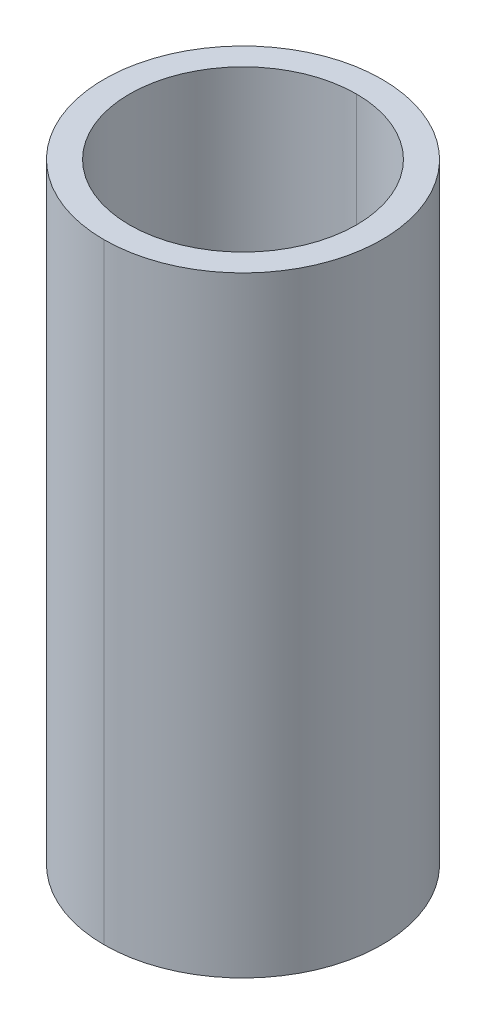
ISO-10303-21;
HEADER;
FILE_DESCRIPTION(('STEP AP214'),'2;1');
FILE_NAME('part.step','',(''),(''),'','','');
FILE_SCHEMA(('AUTOMOTIVE_DESIGN { 1 0 10303 214 1 1 1 1 }'));
ENDSEC;
DATA;
#1=APPLICATION_CONTEXT('core data for automotive mechanical design processes');
#2=APPLICATION_PROTOCOL_DEFINITION('international standard','automotive_design',2000,#1);
#3=PRODUCT_CONTEXT('',#1,'mechanical');
#4=PRODUCT('Part','Part','',(#3));
#5=PRODUCT_RELATED_PRODUCT_CATEGORY('part','',(#4));
#6=PRODUCT_DEFINITION_FORMATION('','',#4);
#7=PRODUCT_DEFINITION_CONTEXT('part definition',#1,'design');
#8=PRODUCT_DEFINITION('design','',#6,#7);
#9=PRODUCT_DEFINITION_SHAPE('','',#8);
#10=(LENGTH_UNIT() NAMED_UNIT(*) SI_UNIT(.MILLI.,.METRE.));
#11=(NAMED_UNIT(*) PLANE_ANGLE_UNIT() SI_UNIT($,.RADIAN.));
#12=(NAMED_UNIT(*) SI_UNIT($,.STERADIAN.) SOLID_ANGLE_UNIT());
#13=UNCERTAINTY_MEASURE_WITH_UNIT(LENGTH_MEASURE(1.E-05),#10,'distance_accuracy_value','');
#14=(GEOMETRIC_REPRESENTATION_CONTEXT(3) GLOBAL_UNCERTAINTY_ASSIGNED_CONTEXT((#13)) GLOBAL_UNIT_ASSIGNED_CONTEXT((#10,
#11,#12)) REPRESENTATION_CONTEXT('',''));
#15=CARTESIAN_POINT('',(0.,0.,0.));
#16=DIRECTION('',(0.,0.,1.));
#17=DIRECTION('',(1.,0.,0.));
#18=AXIS2_PLACEMENT_3D('',#15,#16,#17);
#19=CARTESIAN_POINT('',(0.,132.5,0.));
#20=DIRECTION('',(0.,-1.,0.));
#21=DIRECTION('',(0.,0.,-1.));
#22=AXIS2_PLACEMENT_3D('',#19,#20,#21);
#23=CYLINDRICAL_SURFACE('',#22,24.62);
#24=DIRECTION('',(0.,-1.,0.));
#25=VECTOR('',#24,1.);
#26=CARTESIAN_POINT('',(0.,132.5,24.62));
#27=LINE('',#26,#25);
#28=CARTESIAN_POINT('',(0.,132.5,24.62));
#29=VERTEX_POINT('',#28);
#30=CARTESIAN_POINT('',(0.,0.,24.62));
#31=VERTEX_POINT('',#30);
#32=EDGE_CURVE('E78',#29,#31,#27,.T.);
#33=ORIENTED_EDGE('',*,*,#32,.F.);
#34=CARTESIAN_POINT('',(0.,132.5,0.));
#35=DIRECTION('',(0.,1.,0.));
#36=DIRECTION('',(0.,0.,1.));
#37=AXIS2_PLACEMENT_3D('',#34,#35,#36);
#38=CIRCLE('',#37,24.62);
#39=CARTESIAN_POINT('',(0.,132.5,-24.62));
#40=VERTEX_POINT('',#39);
#41=EDGE_CURVE('E70',#29,#40,#38,.T.);
#42=ORIENTED_EDGE('',*,*,#41,.T.);
#43=DIRECTION('',(0.,-1.,0.));
#44=VECTOR('',#43,1.);
#45=CARTESIAN_POINT('',(0.,132.5,-24.62));
#46=LINE('',#45,#44);
#47=CARTESIAN_POINT('',(0.,0.,-24.62));
#48=VERTEX_POINT('',#47);
#49=EDGE_CURVE('E68',#40,#48,#46,.T.);
#50=ORIENTED_EDGE('',*,*,#49,.T.);
#51=CARTESIAN_POINT('',(0.,0.,0.));
#52=DIRECTION('',(0.,1.,0.));
#53=DIRECTION('',(0.,0.,1.));
#54=AXIS2_PLACEMENT_3D('',#51,#52,#53);
#55=CIRCLE('',#54,24.62);
#56=EDGE_CURVE('E11',#31,#48,#55,.T.);
#57=ORIENTED_EDGE('',*,*,#56,.F.);
#58=EDGE_LOOP('',(#33,#42,#50,#57));
#59=FACE_BOUND('',#58,.T.);
#60=ADVANCED_FACE('F17',(#59),#23,.F.);
#61=CARTESIAN_POINT('',(0.,132.5,0.));
#62=DIRECTION('',(0.,-1.,0.));
#63=DIRECTION('',(0.,0.,-1.));
#64=AXIS2_PLACEMENT_3D('',#61,#62,#63);
#65=CYLINDRICAL_SURFACE('',#64,30.16);
#66=DIRECTION('',(0.,-1.,0.));
#67=VECTOR('',#66,1.);
#68=CARTESIAN_POINT('',(0.,132.5,30.16));
#69=LINE('',#68,#67);
#70=CARTESIAN_POINT('',(0.,132.5,30.16));
#71=VERTEX_POINT('',#70);
#72=CARTESIAN_POINT('',(0.,0.,30.16));
#73=VERTEX_POINT('',#72);
#74=EDGE_CURVE('E96',#71,#73,#69,.T.);
#75=ORIENTED_EDGE('',*,*,#74,.F.);
#76=CARTESIAN_POINT('',(0.,132.5,0.));
#77=DIRECTION('',(0.,1.,0.));
#78=DIRECTION('',(0.,0.,1.));
#79=AXIS2_PLACEMENT_3D('',#76,#77,#78);
#80=CIRCLE('',#79,30.16);
#81=CARTESIAN_POINT('',(0.,132.5,-30.16));
#82=VERTEX_POINT('',#81);
#83=EDGE_CURVE('E90',#82,#71,#80,.T.);
#84=ORIENTED_EDGE('',*,*,#83,.F.);
#85=DIRECTION('',(0.,-1.,0.));
#86=VECTOR('',#85,1.);
#87=CARTESIAN_POINT('',(0.,132.5,-30.16));
#88=LINE('',#87,#86);
#89=CARTESIAN_POINT('',(0.,0.,-30.16));
#90=VERTEX_POINT('',#89);
#91=EDGE_CURVE('E88',#82,#90,#88,.T.);
#92=ORIENTED_EDGE('',*,*,#91,.T.);
#93=CARTESIAN_POINT('',(0.,0.,0.));
#94=DIRECTION('',(0.,1.,0.));
#95=DIRECTION('',(0.,0.,1.));
#96=AXIS2_PLACEMENT_3D('',#93,#94,#95);
#97=CIRCLE('',#96,30.16);
#98=EDGE_CURVE('E21',#90,#73,#97,.T.);
#99=ORIENTED_EDGE('',*,*,#98,.T.);
#100=EDGE_LOOP('',(#75,#84,#92,#99));
#101=FACE_BOUND('',#100,.T.);
#102=ADVANCED_FACE('F122',(#101),#65,.T.);
#103=CARTESIAN_POINT('',(0.,0.,0.));
#104=DIRECTION('',(0.,1.,0.));
#105=DIRECTION('',(1.,0.,0.));
#106=AXIS2_PLACEMENT_3D('',#103,#104,#105);
#107=PLANE('',#106);
#108=CARTESIAN_POINT('',(0.,0.,0.));
#109=DIRECTION('',(0.,1.,0.));
#110=DIRECTION('',(0.,0.,1.));
#111=AXIS2_PLACEMENT_3D('',#108,#109,#110);
#112=CIRCLE('',#111,24.62);
#113=EDGE_CURVE('E62',#48,#31,#112,.T.);
#114=ORIENTED_EDGE('',*,*,#113,.T.);
#115=ORIENTED_EDGE('',*,*,#56,.T.);
#116=EDGE_LOOP('',(#114,#115));
#117=FACE_BOUND('',#116,.T.);
#118=ORIENTED_EDGE('',*,*,#98,.F.);
#119=CARTESIAN_POINT('',(0.,0.,0.));
#120=DIRECTION('',(0.,1.,0.));
#121=DIRECTION('',(0.,0.,1.));
#122=AXIS2_PLACEMENT_3D('',#119,#120,#121);
#123=CIRCLE('',#122,30.16);
#124=EDGE_CURVE('E93',#73,#90,#123,.T.);
#125=ORIENTED_EDGE('',*,*,#124,.F.);
#126=EDGE_LOOP('',(#118,#125));
#127=FACE_BOUND('',#126,.T.);
#128=ADVANCED_FACE('F60',(#117,#127),#107,.F.);
#129=CARTESIAN_POINT('',(0.,132.5,0.));
#130=DIRECTION('',(0.,1.,0.));
#131=DIRECTION('',(1.,0.,0.));
#132=AXIS2_PLACEMENT_3D('',#129,#130,#131);
#133=PLANE('',#132);
#134=CARTESIAN_POINT('',(0.,132.5,0.));
#135=DIRECTION('',(0.,1.,0.));
#136=DIRECTION('',(0.,0.,1.));
#137=AXIS2_PLACEMENT_3D('',#134,#135,#136);
#138=CIRCLE('',#137,24.62);
#139=EDGE_CURVE('E85',#40,#29,#138,.T.);
#140=ORIENTED_EDGE('',*,*,#139,.F.);
#141=ORIENTED_EDGE('',*,*,#41,.F.);
#142=EDGE_LOOP('',(#140,#141));
#143=FACE_BOUND('',#142,.T.);
#144=ORIENTED_EDGE('',*,*,#83,.T.);
#145=CARTESIAN_POINT('',(0.,132.5,0.));
#146=DIRECTION('',(0.,1.,0.));
#147=DIRECTION('',(0.,0.,1.));
#148=AXIS2_PLACEMENT_3D('',#145,#146,#147);
#149=CIRCLE('',#148,30.16);
#150=EDGE_CURVE('E75',#71,#82,#149,.T.);
#151=ORIENTED_EDGE('',*,*,#150,.T.);
#152=EDGE_LOOP('',(#144,#151));
#153=FACE_BOUND('',#152,.T.);
#154=ADVANCED_FACE('F19',(#143,#153),#133,.T.);
#155=CARTESIAN_POINT('',(0.,132.5,0.));
#156=DIRECTION('',(0.,-1.,0.));
#157=DIRECTION('',(0.,0.,-1.));
#158=AXIS2_PLACEMENT_3D('',#155,#156,#157);
#159=CYLINDRICAL_SURFACE('',#158,30.16);
#160=ORIENTED_EDGE('',*,*,#150,.F.);
#161=ORIENTED_EDGE('',*,*,#74,.T.);
#162=ORIENTED_EDGE('',*,*,#124,.T.);
#163=ORIENTED_EDGE('',*,*,#91,.F.);
#164=EDGE_LOOP('',(#160,#161,#162,#163));
#165=FACE_BOUND('',#164,.T.);
#166=ADVANCED_FACE('F131',(#165),#159,.T.);
#167=CARTESIAN_POINT('',(0.,132.5,0.));
#168=DIRECTION('',(0.,-1.,0.));
#169=DIRECTION('',(0.,0.,-1.));
#170=AXIS2_PLACEMENT_3D('',#167,#168,#169);
#171=CYLINDRICAL_SURFACE('',#170,24.62);
#172=ORIENTED_EDGE('',*,*,#139,.T.);
#173=ORIENTED_EDGE('',*,*,#32,.T.);
#174=ORIENTED_EDGE('',*,*,#113,.F.);
#175=ORIENTED_EDGE('',*,*,#49,.F.);
#176=EDGE_LOOP('',(#172,#173,#174,#175));
#177=FACE_BOUND('',#176,.T.);
#178=ADVANCED_FACE('F77',(#177),#171,.F.);
#179=CLOSED_SHELL('',(#60,#102,#128,#154,#166,#178));
#180=MANIFOLD_SOLID_BREP('B1',#179);
#181=ADVANCED_BREP_SHAPE_REPRESENTATION('',(#18,#180),#14);
#182=SHAPE_DEFINITION_REPRESENTATION(#9,#181);
ENDSEC;
END-ISO-10303-21;
